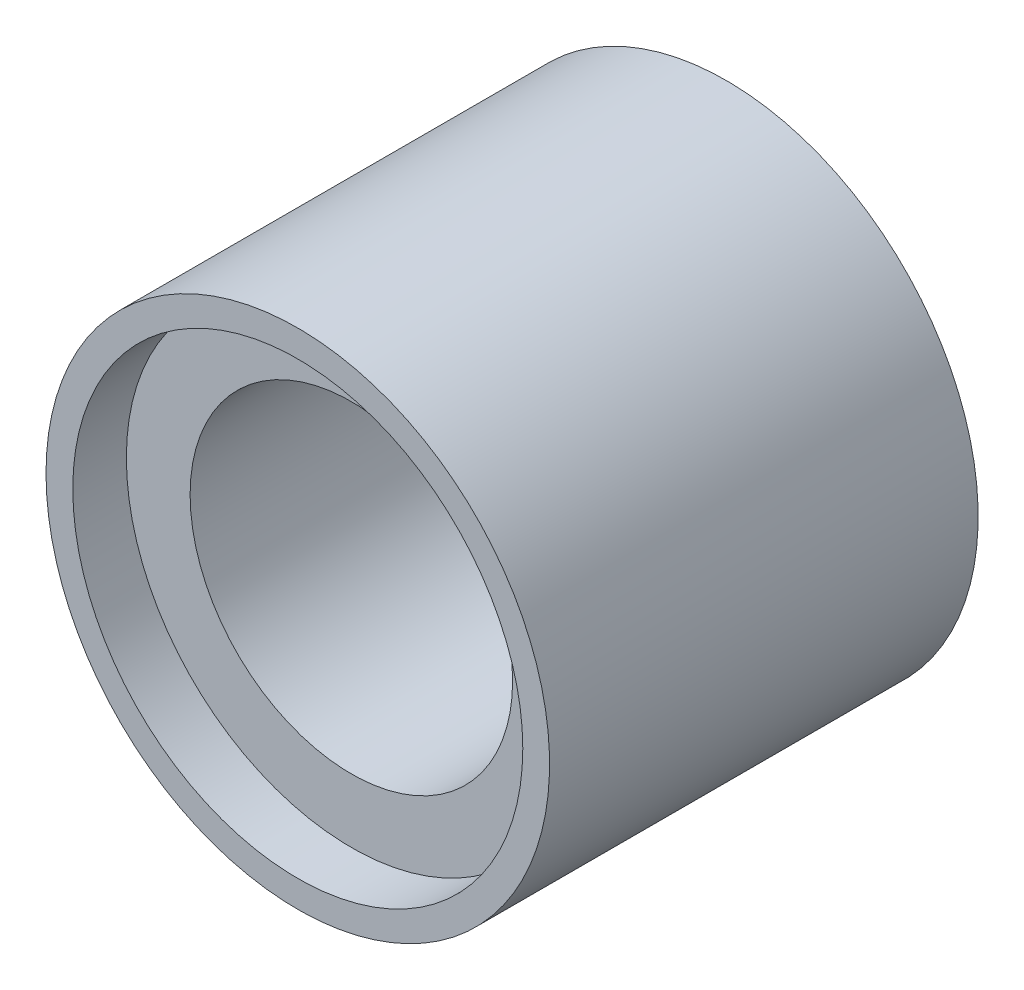
ISO-10303-21;
HEADER;
FILE_DESCRIPTION(('STEP AP214'),'2;1');
FILE_NAME('part.step','',(''),(''),'','','');
FILE_SCHEMA(('AUTOMOTIVE_DESIGN { 1 0 10303 214 1 1 1 1 }'));
ENDSEC;
DATA;
#1=APPLICATION_CONTEXT('core data for automotive mechanical design processes');
#2=APPLICATION_PROTOCOL_DEFINITION('international standard','automotive_design',2000,#1);
#3=PRODUCT_CONTEXT('',#1,'mechanical');
#4=PRODUCT('Part','Part','',(#3));
#5=PRODUCT_RELATED_PRODUCT_CATEGORY('part','',(#4));
#6=PRODUCT_DEFINITION_FORMATION('','',#4);
#7=PRODUCT_DEFINITION_CONTEXT('part definition',#1,'design');
#8=PRODUCT_DEFINITION('design','',#6,#7);
#9=PRODUCT_DEFINITION_SHAPE('','',#8);
#10=(LENGTH_UNIT() NAMED_UNIT(*) SI_UNIT(.MILLI.,.METRE.));
#11=(NAMED_UNIT(*) PLANE_ANGLE_UNIT() SI_UNIT($,.RADIAN.));
#12=(NAMED_UNIT(*) SI_UNIT($,.STERADIAN.) SOLID_ANGLE_UNIT());
#13=UNCERTAINTY_MEASURE_WITH_UNIT(LENGTH_MEASURE(1.E-05),#10,'distance_accuracy_value','');
#14=(GEOMETRIC_REPRESENTATION_CONTEXT(3) GLOBAL_UNCERTAINTY_ASSIGNED_CONTEXT((#13)) GLOBAL_UNIT_ASSIGNED_CONTEXT((#10,
#11,#12)) REPRESENTATION_CONTEXT('',''));
#15=CARTESIAN_POINT('',(0.,0.,0.));
#16=DIRECTION('',(0.,0.,1.));
#17=DIRECTION('',(1.,0.,0.));
#18=AXIS2_PLACEMENT_3D('',#15,#16,#17);
#19=CARTESIAN_POINT('',(0.,0.,15.));
#20=DIRECTION('',(0.,0.,1.));
#21=DIRECTION('',(1.,0.,0.));
#22=AXIS2_PLACEMENT_3D('',#19,#20,#21);
#23=PLANE('',#22);
#24=CARTESIAN_POINT('',(0.,0.,15.));
#25=DIRECTION('',(0.,0.,1.));
#26=DIRECTION('',(1.,0.,0.));
#27=AXIS2_PLACEMENT_3D('',#24,#25,#26);
#28=CIRCLE('',#27,15.05);
#29=CARTESIAN_POINT('',(15.05,0.,15.));
#30=VERTEX_POINT('',#29);
#31=EDGE_CURVE('E12',#30,#30,#28,.T.);
#32=ORIENTED_EDGE('',*,*,#31,.F.);
#33=EDGE_LOOP('',(#32));
#34=FACE_BOUND('',#33,.T.);
#35=CARTESIAN_POINT('',(0.,0.,15.));
#36=DIRECTION('',(0.,0.,-1.));
#37=DIRECTION('',(-1.,0.,0.));
#38=AXIS2_PLACEMENT_3D('',#35,#36,#37);
#39=CIRCLE('',#38,21.);
#40=CARTESIAN_POINT('',(-21.,0.,15.));
#41=VERTEX_POINT('',#40);
#42=EDGE_CURVE('E81',#41,#41,#39,.T.);
#43=ORIENTED_EDGE('',*,*,#42,.F.);
#44=EDGE_LOOP('',(#43));
#45=FACE_BOUND('',#44,.T.);
#46=ADVANCED_FACE('F49',(#34,#45),#23,.T.);
#47=CARTESIAN_POINT('',(0.,0.,-15.));
#48=DIRECTION('',(0.,0.,1.));
#49=DIRECTION('',(1.,0.,0.));
#50=AXIS2_PLACEMENT_3D('',#47,#48,#49);
#51=PLANE('',#50);
#52=CARTESIAN_POINT('',(0.,0.,-15.));
#53=DIRECTION('',(0.,0.,1.));
#54=DIRECTION('',(1.,0.,0.));
#55=AXIS2_PLACEMENT_3D('',#52,#53,#54);
#56=CIRCLE('',#55,15.05);
#57=CARTESIAN_POINT('',(15.05,0.,-15.));
#58=VERTEX_POINT('',#57);
#59=EDGE_CURVE('E53',#58,#58,#56,.T.);
#60=ORIENTED_EDGE('',*,*,#59,.T.);
#61=EDGE_LOOP('',(#60));
#62=FACE_BOUND('',#61,.T.);
#63=CARTESIAN_POINT('',(0.,0.,-15.));
#64=DIRECTION('',(0.,0.,-1.));
#65=DIRECTION('',(-1.,0.,0.));
#66=AXIS2_PLACEMENT_3D('',#63,#64,#65);
#67=CIRCLE('',#66,21.);
#68=CARTESIAN_POINT('',(-21.,0.,-15.));
#69=VERTEX_POINT('',#68);
#70=EDGE_CURVE('E69',#69,#69,#67,.T.);
#71=ORIENTED_EDGE('',*,*,#70,.T.);
#72=EDGE_LOOP('',(#71));
#73=FACE_BOUND('',#72,.T.);
#74=ADVANCED_FACE('F100',(#62,#73),#51,.F.);
#75=CARTESIAN_POINT('',(0.,0.,15.));
#76=DIRECTION('',(0.,0.,-1.));
#77=DIRECTION('',(-1.,0.,0.));
#78=AXIS2_PLACEMENT_3D('',#75,#76,#77);
#79=CYLINDRICAL_SURFACE('',#78,23.5);
#80=CARTESIAN_POINT('',(0.,0.,-20.));
#81=DIRECTION('',(0.,0.,-1.));
#82=DIRECTION('',(-1.,0.,0.));
#83=AXIS2_PLACEMENT_3D('',#80,#81,#82);
#84=CIRCLE('',#83,23.5);
#85=CARTESIAN_POINT('',(-23.5,0.,-20.));
#86=VERTEX_POINT('',#85);
#87=EDGE_CURVE('E63',#86,#86,#84,.T.);
#88=ORIENTED_EDGE('',*,*,#87,.F.);
#89=EDGE_LOOP('',(#88));
#90=FACE_BOUND('',#89,.T.);
#91=CARTESIAN_POINT('',(0.,0.,20.));
#92=DIRECTION('',(0.,0.,-1.));
#93=DIRECTION('',(-1.,0.,0.));
#94=AXIS2_PLACEMENT_3D('',#91,#92,#93);
#95=CIRCLE('',#94,23.5);
#96=CARTESIAN_POINT('',(-23.5,0.,20.));
#97=VERTEX_POINT('',#96);
#98=EDGE_CURVE('E73',#97,#97,#95,.T.);
#99=ORIENTED_EDGE('',*,*,#98,.T.);
#100=EDGE_LOOP('',(#99));
#101=FACE_BOUND('',#100,.T.);
#102=ADVANCED_FACE('F51',(#90,#101),#79,.T.);
#103=CARTESIAN_POINT('',(0.,0.,15.));
#104=DIRECTION('',(0.,0.,-1.));
#105=DIRECTION('',(-1.,0.,0.));
#106=AXIS2_PLACEMENT_3D('',#103,#104,#105);
#107=CYLINDRICAL_SURFACE('',#106,15.05);
#108=ORIENTED_EDGE('',*,*,#31,.T.);
#109=EDGE_LOOP('',(#108));
#110=FACE_BOUND('',#109,.T.);
#111=ORIENTED_EDGE('',*,*,#59,.F.);
#112=EDGE_LOOP('',(#111));
#113=FACE_BOUND('',#112,.T.);
#114=ADVANCED_FACE('F108',(#110,#113),#107,.F.);
#115=CARTESIAN_POINT('',(0.,0.,-20.));
#116=DIRECTION('',(0.,0.,-1.));
#117=DIRECTION('',(-1.,0.,0.));
#118=AXIS2_PLACEMENT_3D('',#115,#116,#117);
#119=PLANE('',#118);
#120=ORIENTED_EDGE('',*,*,#87,.T.);
#121=EDGE_LOOP('',(#120));
#122=FACE_BOUND('',#121,.T.);
#123=CARTESIAN_POINT('',(0.,0.,-20.));
#124=DIRECTION('',(0.,0.,-1.));
#125=DIRECTION('',(-1.,0.,0.));
#126=AXIS2_PLACEMENT_3D('',#123,#124,#125);
#127=CIRCLE('',#126,21.);
#128=CARTESIAN_POINT('',(-21.,0.,-20.));
#129=VERTEX_POINT('',#128);
#130=EDGE_CURVE('E68',#129,#129,#127,.T.);
#131=ORIENTED_EDGE('',*,*,#130,.F.);
#132=EDGE_LOOP('',(#131));
#133=FACE_BOUND('',#132,.T.);
#134=ADVANCED_FACE('F111',(#122,#133),#119,.T.);
#135=CARTESIAN_POINT('',(0.,0.,-20.));
#136=DIRECTION('',(0.,0.,1.));
#137=DIRECTION('',(1.,0.,0.));
#138=AXIS2_PLACEMENT_3D('',#135,#136,#137);
#139=CYLINDRICAL_SURFACE('',#138,21.);
#140=ORIENTED_EDGE('',*,*,#130,.T.);
#141=EDGE_LOOP('',(#140));
#142=FACE_BOUND('',#141,.T.);
#143=ORIENTED_EDGE('',*,*,#70,.F.);
#144=EDGE_LOOP('',(#143));
#145=FACE_BOUND('',#144,.T.);
#146=ADVANCED_FACE('F114',(#142,#145),#139,.F.);
#147=CARTESIAN_POINT('',(0.,0.,20.));
#148=DIRECTION('',(0.,0.,1.));
#149=DIRECTION('',(-1.,0.,0.));
#150=AXIS2_PLACEMENT_3D('',#147,#148,#149);
#151=PLANE('',#150);
#152=CARTESIAN_POINT('',(0.,0.,20.));
#153=DIRECTION('',(0.,0.,-1.));
#154=DIRECTION('',(-1.,0.,0.));
#155=AXIS2_PLACEMENT_3D('',#152,#153,#154);
#156=CIRCLE('',#155,21.);
#157=CARTESIAN_POINT('',(-21.,0.,20.));
#158=VERTEX_POINT('',#157);
#159=EDGE_CURVE('E80',#158,#158,#156,.T.);
#160=ORIENTED_EDGE('',*,*,#159,.T.);
#161=EDGE_LOOP('',(#160));
#162=FACE_BOUND('',#161,.T.);
#163=ORIENTED_EDGE('',*,*,#98,.F.);
#164=EDGE_LOOP('',(#163));
#165=FACE_BOUND('',#164,.T.);
#166=ADVANCED_FACE('F90',(#162,#165),#151,.T.);
#167=CARTESIAN_POINT('',(0.,0.,20.));
#168=DIRECTION('',(0.,0.,-1.));
#169=DIRECTION('',(-1.,0.,0.));
#170=AXIS2_PLACEMENT_3D('',#167,#168,#169);
#171=CYLINDRICAL_SURFACE('',#170,21.);
#172=ORIENTED_EDGE('',*,*,#159,.F.);
#173=EDGE_LOOP('',(#172));
#174=FACE_BOUND('',#173,.T.);
#175=ORIENTED_EDGE('',*,*,#42,.T.);
#176=EDGE_LOOP('',(#175));
#177=FACE_BOUND('',#176,.T.);
#178=ADVANCED_FACE('F93',(#174,#177),#171,.F.);
#179=CLOSED_SHELL('',(#46,#74,#102,#114,#134,#146,#166,#178));
#180=MANIFOLD_SOLID_BREP('B2',#179);
#181=ADVANCED_BREP_SHAPE_REPRESENTATION('',(#18,#180),#14);
#182=SHAPE_DEFINITION_REPRESENTATION(#9,#181);
ENDSEC;
END-ISO-10303-21;
